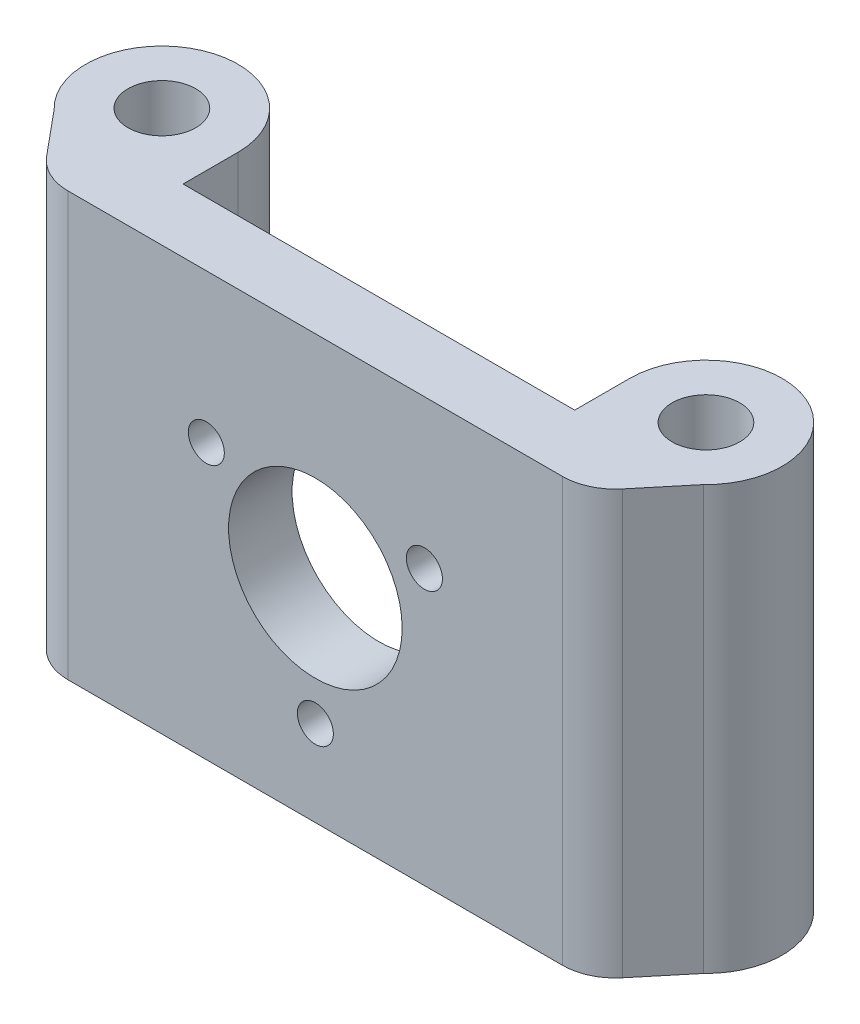
ISO-10303-21;
HEADER;
FILE_DESCRIPTION(('STEP AP214'),'2;1');
FILE_NAME('part.step','',(''),(''),'','','');
FILE_SCHEMA(('AUTOMOTIVE_DESIGN { 1 0 10303 214 1 1 1 1 }'));
ENDSEC;
DATA;
#1=APPLICATION_CONTEXT('core data for automotive mechanical design processes');
#2=APPLICATION_PROTOCOL_DEFINITION('international standard','automotive_design',2000,#1);
#3=PRODUCT_CONTEXT('',#1,'mechanical');
#4=PRODUCT('Part','Part','',(#3));
#5=PRODUCT_RELATED_PRODUCT_CATEGORY('part','',(#4));
#6=PRODUCT_DEFINITION_FORMATION('','',#4);
#7=PRODUCT_DEFINITION_CONTEXT('part definition',#1,'design');
#8=PRODUCT_DEFINITION('design','',#6,#7);
#9=PRODUCT_DEFINITION_SHAPE('','',#8);
#10=(LENGTH_UNIT() NAMED_UNIT(*) SI_UNIT(.MILLI.,.METRE.));
#11=(NAMED_UNIT(*) PLANE_ANGLE_UNIT() SI_UNIT($,.RADIAN.));
#12=(NAMED_UNIT(*) SI_UNIT($,.STERADIAN.) SOLID_ANGLE_UNIT());
#13=UNCERTAINTY_MEASURE_WITH_UNIT(LENGTH_MEASURE(1.E-05),#10,'distance_accuracy_value','');
#14=(GEOMETRIC_REPRESENTATION_CONTEXT(3) GLOBAL_UNCERTAINTY_ASSIGNED_CONTEXT((#13)) GLOBAL_UNIT_ASSIGNED_CONTEXT((#10,
#11,#12)) REPRESENTATION_CONTEXT('',''));
#15=CARTESIAN_POINT('',(0.,0.,0.));
#16=DIRECTION('',(0.,0.,1.));
#17=DIRECTION('',(1.,0.,0.));
#18=AXIS2_PLACEMENT_3D('',#15,#16,#17);
#19=CARTESIAN_POINT('',(0.,20.,-6.00000000000001));
#20=DIRECTION('',(0.,0.,1.));
#21=DIRECTION('',(1.,0.,0.));
#22=AXIS2_PLACEMENT_3D('',#19,#20,#21);
#23=PLANE('',#22);
#24=CARTESIAN_POINT('',(0.,-11.8934155453063,-6.00000000000001));
#25=DIRECTION('',(0.,0.,1.));
#26=DIRECTION('',(1.,0.,0.));
#27=AXIS2_PLACEMENT_3D('',#24,#25,#26);
#28=CIRCLE('',#27,1.7);
#29=CARTESIAN_POINT('',(1.7,-11.8934155453063,-6.00000000000001));
#30=VERTEX_POINT('',#29);
#31=EDGE_CURVE('E425',#30,#30,#28,.T.);
#32=ORIENTED_EDGE('',*,*,#31,.T.);
#33=EDGE_LOOP('',(#32));
#34=FACE_BOUND('',#33,.T.);
#35=CARTESIAN_POINT('',(10.3,5.94670777265314,-6.00000000000001));
#36=DIRECTION('',(0.,0.,1.));
#37=DIRECTION('',(1.,0.,0.));
#38=AXIS2_PLACEMENT_3D('',#35,#36,#37);
#39=CIRCLE('',#38,1.7);
#40=CARTESIAN_POINT('',(12.,5.94670777265314,-6.00000000000001));
#41=VERTEX_POINT('',#40);
#42=EDGE_CURVE('E428',#41,#41,#39,.T.);
#43=ORIENTED_EDGE('',*,*,#42,.T.);
#44=EDGE_LOOP('',(#43));
#45=FACE_BOUND('',#44,.T.);
#46=CARTESIAN_POINT('',(-10.3,5.94670777265314,-6.00000000000001));
#47=DIRECTION('',(0.,0.,1.));
#48=DIRECTION('',(1.,0.,0.));
#49=AXIS2_PLACEMENT_3D('',#46,#47,#48);
#50=CIRCLE('',#49,1.7);
#51=CARTESIAN_POINT('',(-8.6,5.94670777265314,-6.00000000000001));
#52=VERTEX_POINT('',#51);
#53=EDGE_CURVE('E432',#52,#52,#50,.T.);
#54=ORIENTED_EDGE('',*,*,#53,.T.);
#55=EDGE_LOOP('',(#54));
#56=FACE_BOUND('',#55,.T.);
#57=CARTESIAN_POINT('',(0.,0.,-6.00000000000001));
#58=DIRECTION('',(0.,0.,1.));
#59=DIRECTION('',(1.,0.,0.));
#60=AXIS2_PLACEMENT_3D('',#57,#58,#59);
#61=CIRCLE('',#60,8.2);
#62=CARTESIAN_POINT('',(8.2,0.,-6.00000000000001));
#63=VERTEX_POINT('',#62);
#64=EDGE_CURVE('E421',#63,#63,#61,.T.);
#65=ORIENTED_EDGE('',*,*,#64,.T.);
#66=EDGE_LOOP('',(#65));
#67=FACE_BOUND('',#66,.T.);
#68=DIRECTION('',(-1.,0.,0.));
#69=VECTOR('',#68,1.);
#70=CARTESIAN_POINT('',(0.,-20.,-6.00000000000001));
#71=LINE('',#70,#69);
#72=CARTESIAN_POINT('',(18.5,-20.,-6.00000000000001));
#73=VERTEX_POINT('',#72);
#74=CARTESIAN_POINT('',(-18.5,-20.,-6.00000000000001));
#75=VERTEX_POINT('',#74);
#76=EDGE_CURVE('E129',#73,#75,#71,.T.);
#77=ORIENTED_EDGE('',*,*,#76,.T.);
#78=DIRECTION('',(0.,-1.,0.));
#79=VECTOR('',#78,1.);
#80=CARTESIAN_POINT('',(-18.5,20.,-6.00000000000001));
#81=LINE('',#80,#79);
#82=CARTESIAN_POINT('',(-18.5,20.,-6.00000000000001));
#83=VERTEX_POINT('',#82);
#84=EDGE_CURVE('E127',#83,#75,#81,.T.);
#85=ORIENTED_EDGE('',*,*,#84,.F.);
#86=DIRECTION('',(-1.,0.,0.));
#87=VECTOR('',#86,1.);
#88=CARTESIAN_POINT('',(0.,20.,-6.00000000000001));
#89=LINE('',#88,#87);
#90=CARTESIAN_POINT('',(18.5,20.,-6.00000000000001));
#91=VERTEX_POINT('',#90);
#92=EDGE_CURVE('E113',#91,#83,#89,.T.);
#93=ORIENTED_EDGE('',*,*,#92,.F.);
#94=DIRECTION('',(0.,-1.,0.));
#95=VECTOR('',#94,1.);
#96=CARTESIAN_POINT('',(18.5,20.,-6.00000000000001));
#97=LINE('',#96,#95);
#98=EDGE_CURVE('E157',#91,#73,#97,.T.);
#99=ORIENTED_EDGE('',*,*,#98,.T.);
#100=EDGE_LOOP('',(#77,#85,#93,#99));
#101=FACE_BOUND('',#100,.T.);
#102=ADVANCED_FACE('F34',(#34,#45,#56,#67,#101),#23,.F.);
#103=CARTESIAN_POINT('',(-18.5,20.,0.));
#104=DIRECTION('',(1.,0.,0.));
#105=DIRECTION('',(0.,0.,-1.));
#106=AXIS2_PLACEMENT_3D('',#103,#104,#105);
#107=PLANE('',#106);
#108=DIRECTION('',(0.,0.,1.));
#109=VECTOR('',#108,1.);
#110=CARTESIAN_POINT('',(-18.5,-20.,0.));
#111=LINE('',#110,#109);
#112=CARTESIAN_POINT('',(-18.5,-20.,-11.2));
#113=VERTEX_POINT('',#112);
#114=EDGE_CURVE('E159',#113,#75,#111,.T.);
#115=ORIENTED_EDGE('',*,*,#114,.F.);
#116=DIRECTION('',(0.,-1.,0.));
#117=VECTOR('',#116,1.);
#118=CARTESIAN_POINT('',(-18.5,20.,-11.2));
#119=LINE('',#118,#117);
#120=CARTESIAN_POINT('',(-18.5,20.,-11.2));
#121=VERTEX_POINT('',#120);
#122=EDGE_CURVE('E134',#121,#113,#119,.T.);
#123=ORIENTED_EDGE('',*,*,#122,.F.);
#124=DIRECTION('',(0.,0.,1.));
#125=VECTOR('',#124,1.);
#126=CARTESIAN_POINT('',(-18.5,20.,0.));
#127=LINE('',#126,#125);
#128=EDGE_CURVE('E119',#121,#83,#127,.T.);
#129=ORIENTED_EDGE('',*,*,#128,.T.);
#130=ORIENTED_EDGE('',*,*,#84,.T.);
#131=EDGE_LOOP('',(#115,#123,#129,#130));
#132=FACE_BOUND('',#131,.T.);
#133=ADVANCED_FACE('F136',(#132),#107,.T.);
#134=CARTESIAN_POINT('',(-25.7,20.,-11.2));
#135=DIRECTION('',(0.,-1.,0.));
#136=DIRECTION('',(0.,0.,-1.));
#137=AXIS2_PLACEMENT_3D('',#134,#135,#136);
#138=CYLINDRICAL_SURFACE('',#137,7.2);
#139=CARTESIAN_POINT('',(-25.7,-20.,-11.2));
#140=DIRECTION('',(0.,1.,0.));
#141=DIRECTION('',(0.,0.,1.));
#142=AXIS2_PLACEMENT_3D('',#139,#140,#141);
#143=CIRCLE('',#142,7.2);
#144=CARTESIAN_POINT('',(-30.6799598391955,-20.,-6.));
#145=VERTEX_POINT('',#144);
#146=EDGE_CURVE('E162',#145,#113,#143,.F.);
#147=ORIENTED_EDGE('',*,*,#146,.F.);
#148=DIRECTION('',(0.,-1.,0.));
#149=VECTOR('',#148,1.);
#150=CARTESIAN_POINT('',(-30.6799598391955,20.,-6.));
#151=LINE('',#150,#149);
#152=CARTESIAN_POINT('',(-30.6799598391955,20.,-6.));
#153=VERTEX_POINT('',#152);
#154=EDGE_CURVE('E188',#153,#145,#151,.T.);
#155=ORIENTED_EDGE('',*,*,#154,.F.);
#156=CARTESIAN_POINT('',(-25.7,20.,-11.2));
#157=DIRECTION('',(0.,1.,0.));
#158=DIRECTION('',(0.,0.,1.));
#159=AXIS2_PLACEMENT_3D('',#156,#157,#158);
#160=CIRCLE('',#159,7.2);
#161=EDGE_CURVE('E137',#153,#121,#160,.F.);
#162=ORIENTED_EDGE('',*,*,#161,.T.);
#163=ORIENTED_EDGE('',*,*,#122,.T.);
#164=EDGE_LOOP('',(#147,#155,#162,#163));
#165=FACE_BOUND('',#164,.T.);
#166=ADVANCED_FACE('F226',(#165),#138,.T.);
#167=CARTESIAN_POINT('',(-15.2171052631579,20.,12.6300955132228));
#168=DIRECTION('',(-0.769483764063866,0.,0.638666373658505));
#169=DIRECTION('',(0.638666373658505,0.,0.769483764063866));
#170=AXIS2_PLACEMENT_3D('',#167,#168,#169);
#171=PLANE('',#170);
#172=DIRECTION('',(-0.638666373658505,0.,-0.769483764063866));
#173=VECTOR('',#172,1.);
#174=CARTESIAN_POINT('',(-15.2171052631579,-20.,12.6300955132228));
#175=LINE('',#174,#173);
#176=CARTESIAN_POINT('',(-27.1995224564429,-20.,-1.80666813170747));
#177=VERTEX_POINT('',#176);
#178=EDGE_CURVE('E165',#177,#145,#175,.T.);
#179=ORIENTED_EDGE('',*,*,#178,.F.);
#180=DIRECTION('',(0.,-1.,0.));
#181=VECTOR('',#180,1.);
#182=CARTESIAN_POINT('',(-27.1995224564429,20.,-1.80666813170748));
#183=LINE('',#182,#181);
#184=CARTESIAN_POINT('',(-27.1995224564429,20.,-1.80666813170747));
#185=VERTEX_POINT('',#184);
#186=EDGE_CURVE('E11',#177,#185,#183,.F.);
#187=ORIENTED_EDGE('',*,*,#186,.T.);
#188=DIRECTION('',(-0.638666373658505,0.,-0.769483764063866));
#189=VECTOR('',#188,1.);
#190=CARTESIAN_POINT('',(-15.2171052631579,20.,12.6300955132228));
#191=LINE('',#190,#189);
#192=EDGE_CURVE('E139',#185,#153,#191,.T.);
#193=ORIENTED_EDGE('',*,*,#192,.T.);
#194=ORIENTED_EDGE('',*,*,#154,.T.);
#195=EDGE_LOOP('',(#179,#187,#193,#194));
#196=FACE_BOUND('',#195,.T.);
#197=ADVANCED_FACE('F222',(#196),#171,.T.);
#198=CARTESIAN_POINT('',(0.,20.,0.));
#199=DIRECTION('',(0.,0.,-1.));
#200=DIRECTION('',(-1.,0.,0.));
#201=AXIS2_PLACEMENT_3D('',#198,#199,#200);
#202=PLANE('',#201);
#203=CARTESIAN_POINT('',(0.,-11.8934155453063,0.));
#204=DIRECTION('',(0.,0.,1.));
#205=DIRECTION('',(1.,0.,0.));
#206=AXIS2_PLACEMENT_3D('',#203,#204,#205);
#207=CIRCLE('',#206,1.7);
#208=CARTESIAN_POINT('',(1.7,-11.8934155453063,0.));
#209=VERTEX_POINT('',#208);
#210=EDGE_CURVE('E410',#209,#209,#207,.T.);
#211=ORIENTED_EDGE('',*,*,#210,.F.);
#212=EDGE_LOOP('',(#211));
#213=FACE_BOUND('',#212,.T.);
#214=CARTESIAN_POINT('',(10.3,5.94670777265314,0.));
#215=DIRECTION('',(0.,0.,1.));
#216=DIRECTION('',(1.,0.,0.));
#217=AXIS2_PLACEMENT_3D('',#214,#215,#216);
#218=CIRCLE('',#217,1.7);
#219=CARTESIAN_POINT('',(12.,5.94670777265314,0.));
#220=VERTEX_POINT('',#219);
#221=EDGE_CURVE('E414',#220,#220,#218,.T.);
#222=ORIENTED_EDGE('',*,*,#221,.F.);
#223=EDGE_LOOP('',(#222));
#224=FACE_BOUND('',#223,.T.);
#225=CARTESIAN_POINT('',(-10.3,5.94670777265314,0.));
#226=DIRECTION('',(0.,0.,1.));
#227=DIRECTION('',(1.,0.,0.));
#228=AXIS2_PLACEMENT_3D('',#225,#226,#227);
#229=CIRCLE('',#228,1.7);
#230=CARTESIAN_POINT('',(-8.6,5.94670777265314,0.));
#231=VERTEX_POINT('',#230);
#232=EDGE_CURVE('E418',#231,#231,#229,.T.);
#233=ORIENTED_EDGE('',*,*,#232,.F.);
#234=EDGE_LOOP('',(#233));
#235=FACE_BOUND('',#234,.T.);
#236=CARTESIAN_POINT('',(0.,0.,0.));
#237=DIRECTION('',(0.,0.,1.));
#238=DIRECTION('',(1.,0.,0.));
#239=AXIS2_PLACEMENT_3D('',#236,#237,#238);
#240=CIRCLE('',#239,8.2);
#241=CARTESIAN_POINT('',(8.2,0.,0.));
#242=VERTEX_POINT('',#241);
#243=EDGE_CURVE('E160',#242,#242,#240,.T.);
#244=ORIENTED_EDGE('',*,*,#243,.F.);
#245=EDGE_LOOP('',(#244));
#246=FACE_BOUND('',#245,.T.);
#247=DIRECTION('',(1.,0.,0.));
#248=VECTOR('',#247,1.);
#249=CARTESIAN_POINT('',(0.,-20.,0.));
#250=LINE('',#249,#248);
#251=CARTESIAN_POINT('',(-23.3521036361236,-20.,0.));
#252=VERTEX_POINT('',#251);
#253=CARTESIAN_POINT('',(23.3521036361236,-20.,0.));
#254=VERTEX_POINT('',#253);
#255=EDGE_CURVE('E167',#252,#254,#250,.T.);
#256=ORIENTED_EDGE('',*,*,#255,.T.);
#257=DIRECTION('',(0.,-1.,0.));
#258=VECTOR('',#257,1.);
#259=CARTESIAN_POINT('',(23.3521036361236,20.,0.));
#260=LINE('',#259,#258);
#261=CARTESIAN_POINT('',(23.3521036361236,20.,0.));
#262=VERTEX_POINT('',#261);
#263=EDGE_CURVE('E55',#254,#262,#260,.F.);
#264=ORIENTED_EDGE('',*,*,#263,.T.);
#265=DIRECTION('',(1.,0.,0.));
#266=VECTOR('',#265,1.);
#267=CARTESIAN_POINT('',(0.,20.,0.));
#268=LINE('',#267,#266);
#269=CARTESIAN_POINT('',(-23.3521036361236,20.,0.));
#270=VERTEX_POINT('',#269);
#271=EDGE_CURVE('E144',#270,#262,#268,.T.);
#272=ORIENTED_EDGE('',*,*,#271,.F.);
#273=DIRECTION('',(0.,-1.,0.));
#274=VECTOR('',#273,1.);
#275=CARTESIAN_POINT('',(-23.3521036361236,-20.,0.));
#276=LINE('',#275,#274);
#277=EDGE_CURVE('E198',#270,#252,#276,.T.);
#278=ORIENTED_EDGE('',*,*,#277,.T.);
#279=EDGE_LOOP('',(#256,#264,#272,#278));
#280=FACE_BOUND('',#279,.T.);
#281=ADVANCED_FACE('F218',(#213,#224,#235,#246,#280),#202,.F.);
#282=CARTESIAN_POINT('',(15.2171052631579,20.,12.6300955132228));
#283=DIRECTION('',(-0.769483764063866,0.,-0.638666373658505));
#284=DIRECTION('',(-0.638666373658505,0.,0.769483764063866));
#285=AXIS2_PLACEMENT_3D('',#282,#283,#284);
#286=PLANE('',#285);
#287=DIRECTION('',(0.638666373658505,0.,-0.769483764063866));
#288=VECTOR('',#287,1.);
#289=CARTESIAN_POINT('',(15.2171052631579,20.,12.6300955132228));
#290=LINE('',#289,#288);
#291=CARTESIAN_POINT('',(27.1995224564429,20.,-1.80666813170748));
#292=VERTEX_POINT('',#291);
#293=CARTESIAN_POINT('',(30.6799598391955,20.,-6.));
#294=VERTEX_POINT('',#293);
#295=EDGE_CURVE('E146',#292,#294,#290,.T.);
#296=ORIENTED_EDGE('',*,*,#295,.F.);
#297=DIRECTION('',(0.,-1.,0.));
#298=VECTOR('',#297,1.);
#299=CARTESIAN_POINT('',(27.1995224564429,20.,-1.80666813170747));
#300=LINE('',#299,#298);
#301=CARTESIAN_POINT('',(27.1995224564429,-20.,-1.80666813170748));
#302=VERTEX_POINT('',#301);
#303=EDGE_CURVE('E133',#292,#302,#300,.T.);
#304=ORIENTED_EDGE('',*,*,#303,.T.);
#305=DIRECTION('',(0.638666373658505,0.,-0.769483764063866));
#306=VECTOR('',#305,1.);
#307=CARTESIAN_POINT('',(15.2171052631579,-20.,12.6300955132228));
#308=LINE('',#307,#306);
#309=CARTESIAN_POINT('',(30.6799598391955,-20.,-6.));
#310=VERTEX_POINT('',#309);
#311=EDGE_CURVE('E169',#302,#310,#308,.T.);
#312=ORIENTED_EDGE('',*,*,#311,.T.);
#313=DIRECTION('',(0.,-1.,0.));
#314=VECTOR('',#313,1.);
#315=CARTESIAN_POINT('',(30.6799598391955,20.,-6.));
#316=LINE('',#315,#314);
#317=EDGE_CURVE('E185',#294,#310,#316,.T.);
#318=ORIENTED_EDGE('',*,*,#317,.F.);
#319=EDGE_LOOP('',(#296,#304,#312,#318));
#320=FACE_BOUND('',#319,.T.);
#321=ADVANCED_FACE('F209',(#320),#286,.F.);
#322=CARTESIAN_POINT('',(25.7,20.,-11.2));
#323=DIRECTION('',(0.,-1.,0.));
#324=DIRECTION('',(0.,0.,-1.));
#325=AXIS2_PLACEMENT_3D('',#322,#323,#324);
#326=CYLINDRICAL_SURFACE('',#325,7.2);
#327=CARTESIAN_POINT('',(25.7,-20.,-11.2));
#328=DIRECTION('',(0.,1.,0.));
#329=DIRECTION('',(0.,0.,1.));
#330=AXIS2_PLACEMENT_3D('',#327,#328,#329);
#331=CIRCLE('',#330,7.2);
#332=CARTESIAN_POINT('',(18.5,-20.,-11.2));
#333=VERTEX_POINT('',#332);
#334=EDGE_CURVE('E171',#310,#333,#331,.T.);
#335=ORIENTED_EDGE('',*,*,#334,.T.);
#336=DIRECTION('',(0.,-1.,0.));
#337=VECTOR('',#336,1.);
#338=CARTESIAN_POINT('',(18.5,20.,-11.2));
#339=LINE('',#338,#337);
#340=CARTESIAN_POINT('',(18.5,20.,-11.2));
#341=VERTEX_POINT('',#340);
#342=EDGE_CURVE('E183',#341,#333,#339,.T.);
#343=ORIENTED_EDGE('',*,*,#342,.F.);
#344=CARTESIAN_POINT('',(25.7,20.,-11.2));
#345=DIRECTION('',(0.,1.,0.));
#346=DIRECTION('',(0.,0.,1.));
#347=AXIS2_PLACEMENT_3D('',#344,#345,#346);
#348=CIRCLE('',#347,7.2);
#349=EDGE_CURVE('E148',#294,#341,#348,.T.);
#350=ORIENTED_EDGE('',*,*,#349,.F.);
#351=ORIENTED_EDGE('',*,*,#317,.T.);
#352=EDGE_LOOP('',(#335,#343,#350,#351));
#353=FACE_BOUND('',#352,.T.);
#354=ADVANCED_FACE('F232',(#353),#326,.T.);
#355=CARTESIAN_POINT('',(25.7,20.,-11.2));
#356=DIRECTION('',(0.,-1.,0.));
#357=DIRECTION('',(0.,0.,-1.));
#358=AXIS2_PLACEMENT_3D('',#355,#356,#357);
#359=CYLINDRICAL_SURFACE('',#358,3.2);
#360=CARTESIAN_POINT('',(25.7,20.,-11.2));
#361=DIRECTION('',(0.,1.,0.));
#362=DIRECTION('',(0.,0.,1.));
#363=AXIS2_PLACEMENT_3D('',#360,#361,#362);
#364=CIRCLE('',#363,3.2);
#365=CARTESIAN_POINT('',(25.7,20.,-8.));
#366=VERTEX_POINT('',#365);
#367=EDGE_CURVE('E151',#366,#366,#364,.T.);
#368=ORIENTED_EDGE('',*,*,#367,.T.);
#369=EDGE_LOOP('',(#368));
#370=FACE_BOUND('',#369,.T.);
#371=CARTESIAN_POINT('',(25.7,-20.,-11.2));
#372=DIRECTION('',(0.,1.,0.));
#373=DIRECTION('',(0.,0.,1.));
#374=AXIS2_PLACEMENT_3D('',#371,#372,#373);
#375=CIRCLE('',#374,3.2);
#376=CARTESIAN_POINT('',(25.7,-20.,-8.));
#377=VERTEX_POINT('',#376);
#378=EDGE_CURVE('E177',#377,#377,#375,.T.);
#379=ORIENTED_EDGE('',*,*,#378,.F.);
#380=EDGE_LOOP('',(#379));
#381=FACE_BOUND('',#380,.T.);
#382=ADVANCED_FACE('F234',(#370,#381),#359,.F.);
#383=CARTESIAN_POINT('',(18.5,20.,0.));
#384=DIRECTION('',(-1.,0.,0.));
#385=DIRECTION('',(0.,0.,1.));
#386=AXIS2_PLACEMENT_3D('',#383,#384,#385);
#387=PLANE('',#386);
#388=DIRECTION('',(0.,0.,-1.));
#389=VECTOR('',#388,1.);
#390=CARTESIAN_POINT('',(18.5,-20.,0.));
#391=LINE('',#390,#389);
#392=EDGE_CURVE('E174',#73,#333,#391,.T.);
#393=ORIENTED_EDGE('',*,*,#392,.F.);
#394=ORIENTED_EDGE('',*,*,#98,.F.);
#395=DIRECTION('',(0.,0.,-1.));
#396=VECTOR('',#395,1.);
#397=CARTESIAN_POINT('',(18.5,20.,0.));
#398=LINE('',#397,#396);
#399=EDGE_CURVE('E122',#91,#341,#398,.T.);
#400=ORIENTED_EDGE('',*,*,#399,.T.);
#401=ORIENTED_EDGE('',*,*,#342,.T.);
#402=EDGE_LOOP('',(#393,#394,#400,#401));
#403=FACE_BOUND('',#402,.T.);
#404=ADVANCED_FACE('F229',(#403),#387,.T.);
#405=CARTESIAN_POINT('',(-25.7,20.,-11.2));
#406=DIRECTION('',(0.,-1.,0.));
#407=DIRECTION('',(0.,0.,-1.));
#408=AXIS2_PLACEMENT_3D('',#405,#406,#407);
#409=CYLINDRICAL_SURFACE('',#408,3.2);
#410=CARTESIAN_POINT('',(-25.7,20.,-11.2));
#411=DIRECTION('',(0.,1.,0.));
#412=DIRECTION('',(0.,0.,1.));
#413=AXIS2_PLACEMENT_3D('',#410,#411,#412);
#414=CIRCLE('',#413,3.2);
#415=CARTESIAN_POINT('',(-25.7,20.,-8.));
#416=VERTEX_POINT('',#415);
#417=EDGE_CURVE('E154',#416,#416,#414,.F.);
#418=ORIENTED_EDGE('',*,*,#417,.F.);
#419=EDGE_LOOP('',(#418));
#420=FACE_BOUND('',#419,.T.);
#421=CARTESIAN_POINT('',(-25.7,-20.,-11.2));
#422=DIRECTION('',(0.,1.,0.));
#423=DIRECTION('',(0.,0.,1.));
#424=AXIS2_PLACEMENT_3D('',#421,#422,#423);
#425=CIRCLE('',#424,3.2);
#426=CARTESIAN_POINT('',(-25.7,-20.,-8.));
#427=VERTEX_POINT('',#426);
#428=EDGE_CURVE('E124',#427,#427,#425,.F.);
#429=ORIENTED_EDGE('',*,*,#428,.T.);
#430=EDGE_LOOP('',(#429));
#431=FACE_BOUND('',#430,.T.);
#432=ADVANCED_FACE('F279',(#420,#431),#409,.F.);
#433=CARTESIAN_POINT('',(0.,20.,0.));
#434=DIRECTION('',(0.,1.,0.));
#435=DIRECTION('',(0.,0.,1.));
#436=AXIS2_PLACEMENT_3D('',#433,#434,#435);
#437=PLANE('',#436);
#438=ORIENTED_EDGE('',*,*,#271,.T.);
#439=CARTESIAN_POINT('',(23.3521036361236,20.,-5.));
#440=DIRECTION('',(0.,1.,0.));
#441=DIRECTION('',(0.,0.,1.));
#442=AXIS2_PLACEMENT_3D('',#439,#440,#441);
#443=CIRCLE('',#442,5.);
#444=EDGE_CURVE('E42',#262,#292,#443,.T.);
#445=ORIENTED_EDGE('',*,*,#444,.T.);
#446=ORIENTED_EDGE('',*,*,#295,.T.);
#447=ORIENTED_EDGE('',*,*,#349,.T.);
#448=ORIENTED_EDGE('',*,*,#399,.F.);
#449=ORIENTED_EDGE('',*,*,#92,.T.);
#450=ORIENTED_EDGE('',*,*,#128,.F.);
#451=ORIENTED_EDGE('',*,*,#161,.F.);
#452=ORIENTED_EDGE('',*,*,#192,.F.);
#453=CARTESIAN_POINT('',(-23.3521036361236,20.,-5.));
#454=DIRECTION('',(0.,1.,0.));
#455=DIRECTION('',(0.,0.,1.));
#456=AXIS2_PLACEMENT_3D('',#453,#454,#455);
#457=CIRCLE('',#456,5.);
#458=EDGE_CURVE('E202',#185,#270,#457,.T.);
#459=ORIENTED_EDGE('',*,*,#458,.T.);
#460=EDGE_LOOP('',(#438,#445,#446,#447,#448,#449,#450,#451,#452,#459));
#461=FACE_BOUND('',#460,.T.);
#462=ORIENTED_EDGE('',*,*,#367,.F.);
#463=EDGE_LOOP('',(#462));
#464=FACE_BOUND('',#463,.T.);
#465=ORIENTED_EDGE('',*,*,#417,.T.);
#466=EDGE_LOOP('',(#465));
#467=FACE_BOUND('',#466,.T.);
#468=ADVANCED_FACE('F115',(#461,#464,#467),#437,.T.);
#469=CARTESIAN_POINT('',(0.,-20.,0.));
#470=DIRECTION('',(0.,1.,0.));
#471=DIRECTION('',(0.,0.,1.));
#472=AXIS2_PLACEMENT_3D('',#469,#470,#471);
#473=PLANE('',#472);
#474=ORIENTED_EDGE('',*,*,#311,.F.);
#475=CARTESIAN_POINT('',(23.3521036361236,-20.,-5.));
#476=DIRECTION('',(0.,1.,0.));
#477=DIRECTION('',(0.,0.,1.));
#478=AXIS2_PLACEMENT_3D('',#475,#476,#477);
#479=CIRCLE('',#478,5.);
#480=EDGE_CURVE('E196',#302,#254,#479,.F.);
#481=ORIENTED_EDGE('',*,*,#480,.T.);
#482=ORIENTED_EDGE('',*,*,#255,.F.);
#483=CARTESIAN_POINT('',(-23.3521036361236,-20.,-5.));
#484=DIRECTION('',(0.,1.,0.));
#485=DIRECTION('',(0.,0.,1.));
#486=AXIS2_PLACEMENT_3D('',#483,#484,#485);
#487=CIRCLE('',#486,5.);
#488=EDGE_CURVE('E194',#252,#177,#487,.F.);
#489=ORIENTED_EDGE('',*,*,#488,.T.);
#490=ORIENTED_EDGE('',*,*,#178,.T.);
#491=ORIENTED_EDGE('',*,*,#146,.T.);
#492=ORIENTED_EDGE('',*,*,#114,.T.);
#493=ORIENTED_EDGE('',*,*,#76,.F.);
#494=ORIENTED_EDGE('',*,*,#392,.T.);
#495=ORIENTED_EDGE('',*,*,#334,.F.);
#496=EDGE_LOOP('',(#474,#481,#482,#489,#490,#491,#492,#493,#494,#495));
#497=FACE_BOUND('',#496,.T.);
#498=ORIENTED_EDGE('',*,*,#378,.T.);
#499=EDGE_LOOP('',(#498));
#500=FACE_BOUND('',#499,.T.);
#501=ORIENTED_EDGE('',*,*,#428,.F.);
#502=EDGE_LOOP('',(#501));
#503=FACE_BOUND('',#502,.T.);
#504=ADVANCED_FACE('F215',(#497,#500,#503),#473,.F.);
#505=CARTESIAN_POINT('',(0.,0.,0.));
#506=DIRECTION('',(0.,0.,-1.));
#507=DIRECTION('',(-1.,0.,0.));
#508=AXIS2_PLACEMENT_3D('',#505,#506,#507);
#509=CYLINDRICAL_SURFACE('',#508,8.2);
#510=ORIENTED_EDGE('',*,*,#243,.T.);
#511=EDGE_LOOP('',(#510));
#512=FACE_BOUND('',#511,.T.);
#513=ORIENTED_EDGE('',*,*,#64,.F.);
#514=EDGE_LOOP('',(#513));
#515=FACE_BOUND('',#514,.T.);
#516=ADVANCED_FACE('F273',(#512,#515),#509,.F.);
#517=CARTESIAN_POINT('',(-10.3,5.94670777265314,0.));
#518=DIRECTION('',(0.,0.,-1.));
#519=DIRECTION('',(-1.,0.,0.));
#520=AXIS2_PLACEMENT_3D('',#517,#518,#519);
#521=CYLINDRICAL_SURFACE('',#520,1.7);
#522=ORIENTED_EDGE('',*,*,#232,.T.);
#523=EDGE_LOOP('',(#522));
#524=FACE_BOUND('',#523,.T.);
#525=ORIENTED_EDGE('',*,*,#53,.F.);
#526=EDGE_LOOP('',(#525));
#527=FACE_BOUND('',#526,.T.);
#528=ADVANCED_FACE('F266',(#524,#527),#521,.F.);
#529=CARTESIAN_POINT('',(10.3,5.94670777265314,0.));
#530=DIRECTION('',(0.,0.,-1.));
#531=DIRECTION('',(-1.,0.,0.));
#532=AXIS2_PLACEMENT_3D('',#529,#530,#531);
#533=CYLINDRICAL_SURFACE('',#532,1.7);
#534=ORIENTED_EDGE('',*,*,#221,.T.);
#535=EDGE_LOOP('',(#534));
#536=FACE_BOUND('',#535,.T.);
#537=ORIENTED_EDGE('',*,*,#42,.F.);
#538=EDGE_LOOP('',(#537));
#539=FACE_BOUND('',#538,.T.);
#540=ADVANCED_FACE('F260',(#536,#539),#533,.F.);
#541=CARTESIAN_POINT('',(0.,-11.8934155453063,0.));
#542=DIRECTION('',(0.,0.,-1.));
#543=DIRECTION('',(-1.,0.,0.));
#544=AXIS2_PLACEMENT_3D('',#541,#542,#543);
#545=CYLINDRICAL_SURFACE('',#544,1.7);
#546=ORIENTED_EDGE('',*,*,#210,.T.);
#547=EDGE_LOOP('',(#546));
#548=FACE_BOUND('',#547,.T.);
#549=ORIENTED_EDGE('',*,*,#31,.F.);
#550=EDGE_LOOP('',(#549));
#551=FACE_BOUND('',#550,.T.);
#552=ADVANCED_FACE('F255',(#548,#551),#545,.F.);
#553=CARTESIAN_POINT('',(23.3521036361236,20.,-5.));
#554=DIRECTION('',(0.,-1.,0.));
#555=DIRECTION('',(0.,0.,-1.));
#556=AXIS2_PLACEMENT_3D('',#553,#554,#555);
#557=CYLINDRICAL_SURFACE('',#556,5.);
#558=ORIENTED_EDGE('',*,*,#444,.F.);
#559=ORIENTED_EDGE('',*,*,#263,.F.);
#560=ORIENTED_EDGE('',*,*,#480,.F.);
#561=ORIENTED_EDGE('',*,*,#303,.F.);
#562=EDGE_LOOP('',(#558,#559,#560,#561));
#563=FACE_BOUND('',#562,.T.);
#564=ADVANCED_FACE('F212',(#563),#557,.T.);
#565=CARTESIAN_POINT('',(-23.3521036361236,20.,-5.));
#566=DIRECTION('',(0.,1.,0.));
#567=DIRECTION('',(0.,0.,1.));
#568=AXIS2_PLACEMENT_3D('',#565,#566,#567);
#569=CYLINDRICAL_SURFACE('',#568,5.);
#570=ORIENTED_EDGE('',*,*,#458,.F.);
#571=ORIENTED_EDGE('',*,*,#186,.F.);
#572=ORIENTED_EDGE('',*,*,#488,.F.);
#573=ORIENTED_EDGE('',*,*,#277,.F.);
#574=EDGE_LOOP('',(#570,#571,#572,#573));
#575=FACE_BOUND('',#574,.T.);
#576=ADVANCED_FACE('F36',(#575),#569,.T.);
#577=CLOSED_SHELL('',(#102,#133,#166,#197,#281,#321,#354,#382,#404,#432,#468,#504,#516,#528,
#540,#552,#564,#576));
#578=MANIFOLD_SOLID_BREP('B2',#577);
#579=ADVANCED_BREP_SHAPE_REPRESENTATION('',(#18,#578),#14);
#580=SHAPE_DEFINITION_REPRESENTATION(#9,#579);
ENDSEC;
END-ISO-10303-21;
